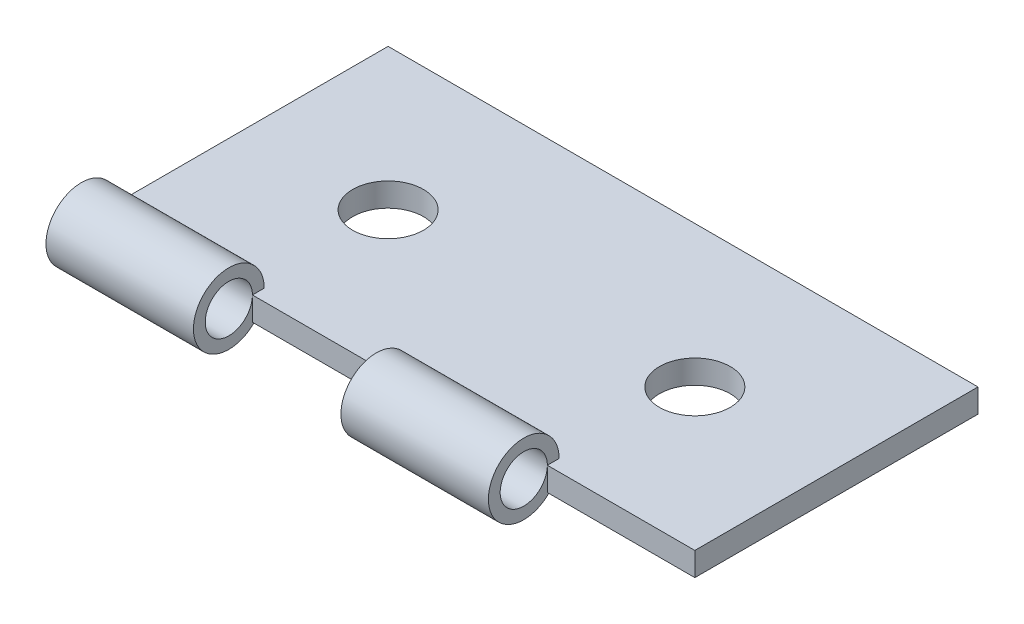
ISO-10303-21;
HEADER;
FILE_DESCRIPTION(('STEP AP214'),'2;1');
FILE_NAME('part.step','',(''),(''),'','','');
FILE_SCHEMA(('AUTOMOTIVE_DESIGN { 1 0 10303 214 1 1 1 1 }'));
ENDSEC;
DATA;
#1=APPLICATION_CONTEXT('core data for automotive mechanical design processes');
#2=APPLICATION_PROTOCOL_DEFINITION('international standard','automotive_design',2000,#1);
#3=PRODUCT_CONTEXT('',#1,'mechanical');
#4=PRODUCT('Part','Part','',(#3));
#5=PRODUCT_RELATED_PRODUCT_CATEGORY('part','',(#4));
#6=PRODUCT_DEFINITION_FORMATION('','',#4);
#7=PRODUCT_DEFINITION_CONTEXT('part definition',#1,'design');
#8=PRODUCT_DEFINITION('design','',#6,#7);
#9=PRODUCT_DEFINITION_SHAPE('','',#8);
#10=(LENGTH_UNIT() NAMED_UNIT(*) SI_UNIT(.MILLI.,.METRE.));
#11=(NAMED_UNIT(*) PLANE_ANGLE_UNIT() SI_UNIT($,.RADIAN.));
#12=(NAMED_UNIT(*) SI_UNIT($,.STERADIAN.) SOLID_ANGLE_UNIT());
#13=UNCERTAINTY_MEASURE_WITH_UNIT(LENGTH_MEASURE(1.E-05),#10,'distance_accuracy_value','');
#14=(GEOMETRIC_REPRESENTATION_CONTEXT(3) GLOBAL_UNCERTAINTY_ASSIGNED_CONTEXT((#13)) GLOBAL_UNIT_ASSIGNED_CONTEXT((#10,
#11,#12)) REPRESENTATION_CONTEXT('',''));
#15=CARTESIAN_POINT('',(0.,0.,0.));
#16=DIRECTION('',(0.,0.,1.));
#17=DIRECTION('',(1.,0.,0.));
#18=AXIS2_PLACEMENT_3D('',#15,#16,#17);
#19=CARTESIAN_POINT('',(0.,1.,0.));
#20=DIRECTION('',(0.,0.,-1.));
#21=DIRECTION('',(-1.,0.,0.));
#22=AXIS2_PLACEMENT_3D('',#19,#20,#21);
#23=PLANE('',#22);
#24=DIRECTION('',(0.,-1.,0.));
#25=VECTOR('',#24,1.);
#26=CARTESIAN_POINT('',(12.5,1.,0.));
#27=LINE('',#26,#25);
#28=CARTESIAN_POINT('',(12.5,1.,0.));
#29=VERTEX_POINT('',#28);
#30=CARTESIAN_POINT('',(12.5,0.,0.));
#31=VERTEX_POINT('',#30);
#32=EDGE_CURVE('E113',#29,#31,#27,.T.);
#33=ORIENTED_EDGE('',*,*,#32,.F.);
#34=DIRECTION('',(1.,0.,0.));
#35=VECTOR('',#34,1.);
#36=CARTESIAN_POINT('',(0.,1.,0.));
#37=LINE('',#36,#35);
#38=CARTESIAN_POINT('',(6.25,1.,0.));
#39=VERTEX_POINT('',#38);
#40=EDGE_CURVE('E158',#39,#29,#37,.T.);
#41=ORIENTED_EDGE('',*,*,#40,.F.);
#42=DIRECTION('',(0.,-1.,0.));
#43=VECTOR('',#42,1.);
#44=CARTESIAN_POINT('',(6.25,1.,0.));
#45=LINE('',#44,#43);
#46=CARTESIAN_POINT('',(6.25,0.,0.));
#47=VERTEX_POINT('',#46);
#48=EDGE_CURVE('E114',#39,#47,#45,.T.);
#49=ORIENTED_EDGE('',*,*,#48,.T.);
#50=DIRECTION('',(1.,0.,0.));
#51=VECTOR('',#50,1.);
#52=CARTESIAN_POINT('',(0.,0.,0.));
#53=LINE('',#52,#51);
#54=EDGE_CURVE('E109',#47,#31,#53,.T.);
#55=ORIENTED_EDGE('',*,*,#54,.T.);
#56=EDGE_LOOP('',(#33,#41,#49,#55));
#57=FACE_BOUND('',#56,.T.);
#58=ADVANCED_FACE('F34',(#57),#23,.F.);
#59=CARTESIAN_POINT('',(0.,1.,0.));
#60=DIRECTION('',(0.,-1.,0.));
#61=DIRECTION('',(0.,0.,-1.));
#62=AXIS2_PLACEMENT_3D('',#59,#60,#61);
#63=PLANE('',#62);
#64=DIRECTION('',(-1.,0.,0.));
#65=VECTOR('',#64,1.);
#66=CARTESIAN_POINT('',(18.75,1.,-0.5));
#67=LINE('',#66,#65);
#68=CARTESIAN_POINT('',(18.75,1.,-0.5));
#69=VERTEX_POINT('',#68);
#70=CARTESIAN_POINT('',(12.5,1.,-0.5));
#71=VERTEX_POINT('',#70);
#72=EDGE_CURVE('E53',#69,#71,#67,.T.);
#73=ORIENTED_EDGE('',*,*,#72,.F.);
#74=DIRECTION('',(0.,0.,1.));
#75=VECTOR('',#74,1.);
#76=CARTESIAN_POINT('',(18.75,1.,0.));
#77=LINE('',#76,#75);
#78=CARTESIAN_POINT('',(18.75,1.,0.));
#79=VERTEX_POINT('',#78);
#80=EDGE_CURVE('E196',#69,#79,#77,.T.);
#81=ORIENTED_EDGE('',*,*,#80,.T.);
#82=CARTESIAN_POINT('',(25.,1.,0.));
#83=VERTEX_POINT('',#82);
#84=EDGE_CURVE('E160',#79,#83,#37,.T.);
#85=ORIENTED_EDGE('',*,*,#84,.T.);
#86=DIRECTION('',(0.,0.,-1.));
#87=VECTOR('',#86,1.);
#88=CARTESIAN_POINT('',(25.,1.,0.));
#89=LINE('',#88,#87);
#90=CARTESIAN_POINT('',(25.,1.,-12.));
#91=VERTEX_POINT('',#90);
#92=EDGE_CURVE('E156',#83,#91,#89,.T.);
#93=ORIENTED_EDGE('',*,*,#92,.T.);
#94=DIRECTION('',(-1.,0.,0.));
#95=VECTOR('',#94,1.);
#96=CARTESIAN_POINT('',(0.,1.,-12.));
#97=LINE('',#96,#95);
#98=CARTESIAN_POINT('',(0.,1.,-12.));
#99=VERTEX_POINT('',#98);
#100=EDGE_CURVE('E146',#91,#99,#97,.T.);
#101=ORIENTED_EDGE('',*,*,#100,.T.);
#102=DIRECTION('',(0.,0.,1.));
#103=VECTOR('',#102,1.);
#104=CARTESIAN_POINT('',(0.,1.,0.));
#105=LINE('',#104,#103);
#106=CARTESIAN_POINT('',(0.,1.,-0.5));
#107=VERTEX_POINT('',#106);
#108=EDGE_CURVE('E149',#99,#107,#105,.T.);
#109=ORIENTED_EDGE('',*,*,#108,.T.);
#110=DIRECTION('',(-1.,0.,0.));
#111=VECTOR('',#110,1.);
#112=CARTESIAN_POINT('',(16.7426406871193,1.,-0.5));
#113=LINE('',#112,#111);
#114=CARTESIAN_POINT('',(6.25,1.,-0.5));
#115=VERTEX_POINT('',#114);
#116=EDGE_CURVE('E172',#115,#107,#113,.T.);
#117=ORIENTED_EDGE('',*,*,#116,.F.);
#118=DIRECTION('',(0.,0.,1.));
#119=VECTOR('',#118,1.);
#120=CARTESIAN_POINT('',(6.25,1.,0.));
#121=LINE('',#120,#119);
#122=EDGE_CURVE('E179',#115,#39,#121,.T.);
#123=ORIENTED_EDGE('',*,*,#122,.T.);
#124=ORIENTED_EDGE('',*,*,#40,.T.);
#125=DIRECTION('',(0.,0.,1.));
#126=VECTOR('',#125,1.);
#127=CARTESIAN_POINT('',(12.5,1.,0.));
#128=LINE('',#127,#126);
#129=EDGE_CURVE('E49',#71,#29,#128,.T.);
#130=ORIENTED_EDGE('',*,*,#129,.F.);
#131=EDGE_LOOP('',(#73,#81,#85,#93,#101,#109,#117,#123,#124,#130));
#132=FACE_BOUND('',#131,.T.);
#133=CARTESIAN_POINT('',(19.,1.,-6.));
#134=DIRECTION('',(0.,1.,0.));
#135=DIRECTION('',(0.,0.,1.));
#136=AXIS2_PLACEMENT_3D('',#133,#134,#135);
#137=CIRCLE('',#136,1.5);
#138=CARTESIAN_POINT('',(19.,1.,-4.5));
#139=VERTEX_POINT('',#138);
#140=EDGE_CURVE('E166',#139,#139,#137,.T.);
#141=ORIENTED_EDGE('',*,*,#140,.F.);
#142=EDGE_LOOP('',(#141));
#143=FACE_BOUND('',#142,.T.);
#144=CARTESIAN_POINT('',(6.,1.,-6.));
#145=DIRECTION('',(0.,1.,0.));
#146=DIRECTION('',(0.,0.,1.));
#147=AXIS2_PLACEMENT_3D('',#144,#145,#146);
#148=CIRCLE('',#147,1.5);
#149=CARTESIAN_POINT('',(6.,1.,-4.5));
#150=VERTEX_POINT('',#149);
#151=EDGE_CURVE('E154',#150,#150,#148,.T.);
#152=ORIENTED_EDGE('',*,*,#151,.F.);
#153=EDGE_LOOP('',(#152));
#154=FACE_BOUND('',#153,.T.);
#155=ADVANCED_FACE('F234',(#132,#143,#154),#63,.F.);
#156=CARTESIAN_POINT('',(0.,0.,0.));
#157=DIRECTION('',(0.,-1.,0.));
#158=DIRECTION('',(0.,0.,-1.));
#159=AXIS2_PLACEMENT_3D('',#156,#157,#158);
#160=PLANE('',#159);
#161=DIRECTION('',(0.,0.,1.));
#162=VECTOR('',#161,1.);
#163=CARTESIAN_POINT('',(18.75,0.,0.));
#164=LINE('',#163,#162);
#165=CARTESIAN_POINT('',(18.75,0.,-0.118033988749895));
#166=VERTEX_POINT('',#165);
#167=CARTESIAN_POINT('',(18.75,0.,0.));
#168=VERTEX_POINT('',#167);
#169=EDGE_CURVE('E198',#166,#168,#164,.T.);
#170=ORIENTED_EDGE('',*,*,#169,.F.);
#171=DIRECTION('',(-1.,0.,0.));
#172=VECTOR('',#171,1.);
#173=CARTESIAN_POINT('',(18.75,0.,-0.118033988749895));
#174=LINE('',#173,#172);
#175=CARTESIAN_POINT('',(12.5,0.,-0.118033988749895));
#176=VERTEX_POINT('',#175);
#177=EDGE_CURVE('E12',#166,#176,#174,.T.);
#178=ORIENTED_EDGE('',*,*,#177,.T.);
#179=DIRECTION('',(0.,0.,1.));
#180=VECTOR('',#179,1.);
#181=CARTESIAN_POINT('',(12.5,0.,0.));
#182=LINE('',#181,#180);
#183=EDGE_CURVE('E121',#176,#31,#182,.T.);
#184=ORIENTED_EDGE('',*,*,#183,.T.);
#185=ORIENTED_EDGE('',*,*,#54,.F.);
#186=DIRECTION('',(0.,0.,1.));
#187=VECTOR('',#186,1.);
#188=CARTESIAN_POINT('',(6.25,0.,0.));
#189=LINE('',#188,#187);
#190=CARTESIAN_POINT('',(6.25,0.,-0.118033988749895));
#191=VERTEX_POINT('',#190);
#192=EDGE_CURVE('E182',#191,#47,#189,.T.);
#193=ORIENTED_EDGE('',*,*,#192,.F.);
#194=DIRECTION('',(-1.,0.,0.));
#195=VECTOR('',#194,1.);
#196=CARTESIAN_POINT('',(16.7426406871193,0.,-0.118033988749895));
#197=LINE('',#196,#195);
#198=CARTESIAN_POINT('',(0.,0.,-0.118033988749895));
#199=VERTEX_POINT('',#198);
#200=EDGE_CURVE('E176',#191,#199,#197,.T.);
#201=ORIENTED_EDGE('',*,*,#200,.T.);
#202=DIRECTION('',(0.,0.,1.));
#203=VECTOR('',#202,1.);
#204=CARTESIAN_POINT('',(0.,0.,0.));
#205=LINE('',#204,#203);
#206=CARTESIAN_POINT('',(0.,0.,-12.));
#207=VERTEX_POINT('',#206);
#208=EDGE_CURVE('E151',#207,#199,#205,.T.);
#209=ORIENTED_EDGE('',*,*,#208,.F.);
#210=DIRECTION('',(-1.,0.,0.));
#211=VECTOR('',#210,1.);
#212=CARTESIAN_POINT('',(0.,0.,-12.));
#213=LINE('',#212,#211);
#214=CARTESIAN_POINT('',(25.,0.,-12.));
#215=VERTEX_POINT('',#214);
#216=EDGE_CURVE('E147',#215,#207,#213,.T.);
#217=ORIENTED_EDGE('',*,*,#216,.F.);
#218=DIRECTION('',(0.,0.,-1.));
#219=VECTOR('',#218,1.);
#220=CARTESIAN_POINT('',(25.,0.,0.));
#221=LINE('',#220,#219);
#222=CARTESIAN_POINT('',(25.,0.,0.));
#223=VERTEX_POINT('',#222);
#224=EDGE_CURVE('E117',#223,#215,#221,.T.);
#225=ORIENTED_EDGE('',*,*,#224,.F.);
#226=EDGE_CURVE('E118',#168,#223,#53,.T.);
#227=ORIENTED_EDGE('',*,*,#226,.F.);
#228=EDGE_LOOP('',(#170,#178,#184,#185,#193,#201,#209,#217,#225,#227));
#229=FACE_BOUND('',#228,.T.);
#230=CARTESIAN_POINT('',(6.,0.,-6.));
#231=DIRECTION('',(0.,1.,0.));
#232=DIRECTION('',(0.,0.,1.));
#233=AXIS2_PLACEMENT_3D('',#230,#231,#232);
#234=CIRCLE('',#233,1.5);
#235=CARTESIAN_POINT('',(6.,0.,-4.5));
#236=VERTEX_POINT('',#235);
#237=EDGE_CURVE('E163',#236,#236,#234,.T.);
#238=ORIENTED_EDGE('',*,*,#237,.T.);
#239=EDGE_LOOP('',(#238));
#240=FACE_BOUND('',#239,.T.);
#241=CARTESIAN_POINT('',(19.,0.,-6.));
#242=DIRECTION('',(0.,1.,0.));
#243=DIRECTION('',(0.,0.,1.));
#244=AXIS2_PLACEMENT_3D('',#241,#242,#243);
#245=CIRCLE('',#244,1.5);
#246=CARTESIAN_POINT('',(19.,0.,-4.5));
#247=VERTEX_POINT('',#246);
#248=EDGE_CURVE('E169',#247,#247,#245,.T.);
#249=ORIENTED_EDGE('',*,*,#248,.T.);
#250=EDGE_LOOP('',(#249));
#251=FACE_BOUND('',#250,.T.);
#252=ADVANCED_FACE('F122',(#229,#240,#251),#160,.T.);
#253=CARTESIAN_POINT('',(0.,1.,0.));
#254=DIRECTION('',(1.,0.,0.));
#255=DIRECTION('',(0.,0.,-1.));
#256=AXIS2_PLACEMENT_3D('',#253,#254,#255);
#257=PLANE('',#256);
#258=CARTESIAN_POINT('',(0.,1.,1.));
#259=DIRECTION('',(1.,0.,0.));
#260=DIRECTION('',(0.,0.,-1.));
#261=AXIS2_PLACEMENT_3D('',#258,#259,#260);
#262=CIRCLE('',#261,1.);
#263=CARTESIAN_POINT('',(0.,1.,0.));
#264=VERTEX_POINT('',#263);
#265=EDGE_CURVE('E188',#264,#264,#262,.T.);
#266=ORIENTED_EDGE('',*,*,#265,.T.);
#267=EDGE_LOOP('',(#266));
#268=FACE_BOUND('',#267,.T.);
#269=ORIENTED_EDGE('',*,*,#208,.T.);
#270=CARTESIAN_POINT('',(0.,1.,1.));
#271=DIRECTION('',(1.,0.,0.));
#272=DIRECTION('',(0.,0.,-1.));
#273=AXIS2_PLACEMENT_3D('',#270,#271,#272);
#274=CIRCLE('',#273,1.5);
#275=EDGE_CURVE('E189',#107,#199,#274,.T.);
#276=ORIENTED_EDGE('',*,*,#275,.F.);
#277=ORIENTED_EDGE('',*,*,#108,.F.);
#278=DIRECTION('',(0.,-1.,0.));
#279=VECTOR('',#278,1.);
#280=CARTESIAN_POINT('',(0.,1.,-12.));
#281=LINE('',#280,#279);
#282=EDGE_CURVE('E143',#99,#207,#281,.T.);
#283=ORIENTED_EDGE('',*,*,#282,.T.);
#284=EDGE_LOOP('',(#269,#276,#277,#283));
#285=FACE_BOUND('',#284,.T.);
#286=ADVANCED_FACE('F36',(#268,#285),#257,.F.);
#287=ORIENTED_EDGE('',*,*,#84,.F.);
#288=DIRECTION('',(0.,-1.,0.));
#289=VECTOR('',#288,1.);
#290=CARTESIAN_POINT('',(18.75,1.,0.));
#291=LINE('',#290,#289);
#292=EDGE_CURVE('E42',#79,#168,#291,.T.);
#293=ORIENTED_EDGE('',*,*,#292,.T.);
#294=ORIENTED_EDGE('',*,*,#226,.T.);
#295=DIRECTION('',(0.,-1.,0.));
#296=VECTOR('',#295,1.);
#297=CARTESIAN_POINT('',(25.,1.,0.));
#298=LINE('',#297,#296);
#299=EDGE_CURVE('E135',#83,#223,#298,.T.);
#300=ORIENTED_EDGE('',*,*,#299,.F.);
#301=EDGE_LOOP('',(#287,#293,#294,#300));
#302=FACE_BOUND('',#301,.T.);
#303=ADVANCED_FACE('F220',(#302),#23,.F.);
#304=CARTESIAN_POINT('',(25.,1.,0.));
#305=DIRECTION('',(-1.,0.,0.));
#306=DIRECTION('',(0.,0.,1.));
#307=AXIS2_PLACEMENT_3D('',#304,#305,#306);
#308=PLANE('',#307);
#309=ORIENTED_EDGE('',*,*,#224,.T.);
#310=DIRECTION('',(0.,-1.,0.));
#311=VECTOR('',#310,1.);
#312=CARTESIAN_POINT('',(25.,1.,-12.));
#313=LINE('',#312,#311);
#314=EDGE_CURVE('E140',#91,#215,#313,.T.);
#315=ORIENTED_EDGE('',*,*,#314,.F.);
#316=ORIENTED_EDGE('',*,*,#92,.F.);
#317=ORIENTED_EDGE('',*,*,#299,.T.);
#318=EDGE_LOOP('',(#309,#315,#316,#317));
#319=FACE_BOUND('',#318,.T.);
#320=ADVANCED_FACE('F227',(#319),#308,.F.);
#321=CARTESIAN_POINT('',(0.,1.,-12.));
#322=DIRECTION('',(0.,0.,1.));
#323=DIRECTION('',(1.,0.,0.));
#324=AXIS2_PLACEMENT_3D('',#321,#322,#323);
#325=PLANE('',#324);
#326=ORIENTED_EDGE('',*,*,#216,.T.);
#327=ORIENTED_EDGE('',*,*,#282,.F.);
#328=ORIENTED_EDGE('',*,*,#100,.F.);
#329=ORIENTED_EDGE('',*,*,#314,.T.);
#330=EDGE_LOOP('',(#326,#327,#328,#329));
#331=FACE_BOUND('',#330,.T.);
#332=ADVANCED_FACE('F231',(#331),#325,.F.);
#333=CARTESIAN_POINT('',(6.,1.,-6.));
#334=DIRECTION('',(0.,-1.,0.));
#335=DIRECTION('',(0.,0.,-1.));
#336=AXIS2_PLACEMENT_3D('',#333,#334,#335);
#337=CYLINDRICAL_SURFACE('',#336,1.5);
#338=ORIENTED_EDGE('',*,*,#151,.T.);
#339=EDGE_LOOP('',(#338));
#340=FACE_BOUND('',#339,.T.);
#341=ORIENTED_EDGE('',*,*,#237,.F.);
#342=EDGE_LOOP('',(#341));
#343=FACE_BOUND('',#342,.T.);
#344=ADVANCED_FACE('F282',(#340,#343),#337,.F.);
#345=CARTESIAN_POINT('',(19.,1.,-6.));
#346=DIRECTION('',(0.,-1.,0.));
#347=DIRECTION('',(0.,0.,-1.));
#348=AXIS2_PLACEMENT_3D('',#345,#346,#347);
#349=CYLINDRICAL_SURFACE('',#348,1.5);
#350=ORIENTED_EDGE('',*,*,#140,.T.);
#351=EDGE_LOOP('',(#350));
#352=FACE_BOUND('',#351,.T.);
#353=ORIENTED_EDGE('',*,*,#248,.F.);
#354=EDGE_LOOP('',(#353));
#355=FACE_BOUND('',#354,.T.);
#356=ADVANCED_FACE('F286',(#352,#355),#349,.F.);
#357=CARTESIAN_POINT('',(16.7426406871193,1.,1.));
#358=DIRECTION('',(-1.,0.,0.));
#359=DIRECTION('',(0.,0.,1.));
#360=AXIS2_PLACEMENT_3D('',#357,#358,#359);
#361=CYLINDRICAL_SURFACE('',#360,1.5);
#362=CARTESIAN_POINT('',(6.25,1.,1.));
#363=DIRECTION('',(1.,0.,0.));
#364=DIRECTION('',(0.,0.,-1.));
#365=AXIS2_PLACEMENT_3D('',#362,#363,#364);
#366=CIRCLE('',#365,1.5);
#367=EDGE_CURVE('E184',#115,#191,#366,.T.);
#368=ORIENTED_EDGE('',*,*,#367,.F.);
#369=ORIENTED_EDGE('',*,*,#116,.T.);
#370=ORIENTED_EDGE('',*,*,#275,.T.);
#371=ORIENTED_EDGE('',*,*,#200,.F.);
#372=EDGE_LOOP('',(#368,#369,#370,#371));
#373=FACE_BOUND('',#372,.T.);
#374=ADVANCED_FACE('F241',(#373),#361,.T.);
#375=CARTESIAN_POINT('',(6.25,1.,0.));
#376=DIRECTION('',(1.,0.,0.));
#377=DIRECTION('',(0.,0.,-1.));
#378=AXIS2_PLACEMENT_3D('',#375,#376,#377);
#379=PLANE('',#378);
#380=ORIENTED_EDGE('',*,*,#122,.F.);
#381=ORIENTED_EDGE('',*,*,#367,.T.);
#382=ORIENTED_EDGE('',*,*,#192,.T.);
#383=ORIENTED_EDGE('',*,*,#48,.F.);
#384=CARTESIAN_POINT('',(6.25,1.,1.));
#385=DIRECTION('',(1.,0.,0.));
#386=DIRECTION('',(0.,0.,-1.));
#387=AXIS2_PLACEMENT_3D('',#384,#385,#386);
#388=CIRCLE('',#387,1.);
#389=EDGE_CURVE('E185',#39,#39,#388,.T.);
#390=ORIENTED_EDGE('',*,*,#389,.F.);
#391=EDGE_LOOP('',(#380,#381,#382,#383,#390));
#392=FACE_BOUND('',#391,.T.);
#393=ADVANCED_FACE('F243',(#392),#379,.T.);
#394=CARTESIAN_POINT('',(16.7426406871193,1.,1.));
#395=DIRECTION('',(-1.,0.,0.));
#396=DIRECTION('',(0.,0.,1.));
#397=AXIS2_PLACEMENT_3D('',#394,#395,#396);
#398=CYLINDRICAL_SURFACE('',#397,1.);
#399=ORIENTED_EDGE('',*,*,#389,.T.);
#400=EDGE_LOOP('',(#399));
#401=FACE_BOUND('',#400,.T.);
#402=ORIENTED_EDGE('',*,*,#265,.F.);
#403=EDGE_LOOP('',(#402));
#404=FACE_BOUND('',#403,.T.);
#405=ADVANCED_FACE('F248',(#401,#404),#398,.F.);
#406=CARTESIAN_POINT('',(18.75,1.,1.));
#407=DIRECTION('',(-1.,0.,0.));
#408=DIRECTION('',(0.,0.,1.));
#409=AXIS2_PLACEMENT_3D('',#406,#407,#408);
#410=CYLINDRICAL_SURFACE('',#409,1.5);
#411=CARTESIAN_POINT('',(18.75,1.,1.));
#412=DIRECTION('',(1.,0.,0.));
#413=DIRECTION('',(0.,0.,-1.));
#414=AXIS2_PLACEMENT_3D('',#411,#412,#413);
#415=CIRCLE('',#414,1.5);
#416=EDGE_CURVE('E128',#69,#166,#415,.T.);
#417=ORIENTED_EDGE('',*,*,#416,.F.);
#418=ORIENTED_EDGE('',*,*,#72,.T.);
#419=CARTESIAN_POINT('',(12.5,1.,1.));
#420=DIRECTION('',(1.,0.,0.));
#421=DIRECTION('',(0.,0.,-1.));
#422=AXIS2_PLACEMENT_3D('',#419,#420,#421);
#423=CIRCLE('',#422,1.5);
#424=EDGE_CURVE('E202',#71,#176,#423,.T.);
#425=ORIENTED_EDGE('',*,*,#424,.T.);
#426=ORIENTED_EDGE('',*,*,#177,.F.);
#427=EDGE_LOOP('',(#417,#418,#425,#426));
#428=FACE_BOUND('',#427,.T.);
#429=ADVANCED_FACE('F246',(#428),#410,.T.);
#430=CARTESIAN_POINT('',(18.75,1.,1.));
#431=DIRECTION('',(1.,0.,0.));
#432=DIRECTION('',(0.,0.,-1.));
#433=AXIS2_PLACEMENT_3D('',#430,#431,#432);
#434=PLANE('',#433);
#435=ORIENTED_EDGE('',*,*,#80,.F.);
#436=ORIENTED_EDGE('',*,*,#416,.T.);
#437=ORIENTED_EDGE('',*,*,#169,.T.);
#438=ORIENTED_EDGE('',*,*,#292,.F.);
#439=CARTESIAN_POINT('',(18.75,1.,1.));
#440=DIRECTION('',(1.,0.,0.));
#441=DIRECTION('',(0.,0.,-1.));
#442=AXIS2_PLACEMENT_3D('',#439,#440,#441);
#443=CIRCLE('',#442,1.);
#444=EDGE_CURVE('E204',#79,#79,#443,.T.);
#445=ORIENTED_EDGE('',*,*,#444,.F.);
#446=EDGE_LOOP('',(#435,#436,#437,#438,#445));
#447=FACE_BOUND('',#446,.T.);
#448=ADVANCED_FACE('F215',(#447),#434,.T.);
#449=CARTESIAN_POINT('',(12.5,1.,1.));
#450=DIRECTION('',(1.,0.,0.));
#451=DIRECTION('',(0.,0.,-1.));
#452=AXIS2_PLACEMENT_3D('',#449,#450,#451);
#453=PLANE('',#452);
#454=ORIENTED_EDGE('',*,*,#424,.F.);
#455=ORIENTED_EDGE('',*,*,#129,.T.);
#456=CARTESIAN_POINT('',(12.5,1.,1.));
#457=DIRECTION('',(1.,0.,0.));
#458=DIRECTION('',(0.,0.,-1.));
#459=AXIS2_PLACEMENT_3D('',#456,#457,#458);
#460=CIRCLE('',#459,1.);
#461=EDGE_CURVE('E133',#29,#29,#460,.T.);
#462=ORIENTED_EDGE('',*,*,#461,.T.);
#463=ORIENTED_EDGE('',*,*,#32,.T.);
#464=ORIENTED_EDGE('',*,*,#183,.F.);
#465=EDGE_LOOP('',(#454,#455,#462,#463,#464));
#466=FACE_BOUND('',#465,.T.);
#467=ADVANCED_FACE('F131',(#466),#453,.F.);
#468=CARTESIAN_POINT('',(18.75,1.,1.));
#469=DIRECTION('',(-1.,0.,0.));
#470=DIRECTION('',(0.,0.,1.));
#471=AXIS2_PLACEMENT_3D('',#468,#469,#470);
#472=CYLINDRICAL_SURFACE('',#471,1.);
#473=ORIENTED_EDGE('',*,*,#444,.T.);
#474=EDGE_LOOP('',(#473));
#475=FACE_BOUND('',#474,.T.);
#476=ORIENTED_EDGE('',*,*,#461,.F.);
#477=EDGE_LOOP('',(#476));
#478=FACE_BOUND('',#477,.T.);
#479=ADVANCED_FACE('F211',(#475,#478),#472,.F.);
#480=CLOSED_SHELL('',(#58,#155,#252,#286,#303,#320,#332,#344,#356,#374,#393,#405,#429,#448,#467,#479));
#481=MANIFOLD_SOLID_BREP('B2',#480);
#482=ADVANCED_BREP_SHAPE_REPRESENTATION('',(#18,#481),#14);
#483=SHAPE_DEFINITION_REPRESENTATION(#9,#482);
ENDSEC;
END-ISO-10303-21;
